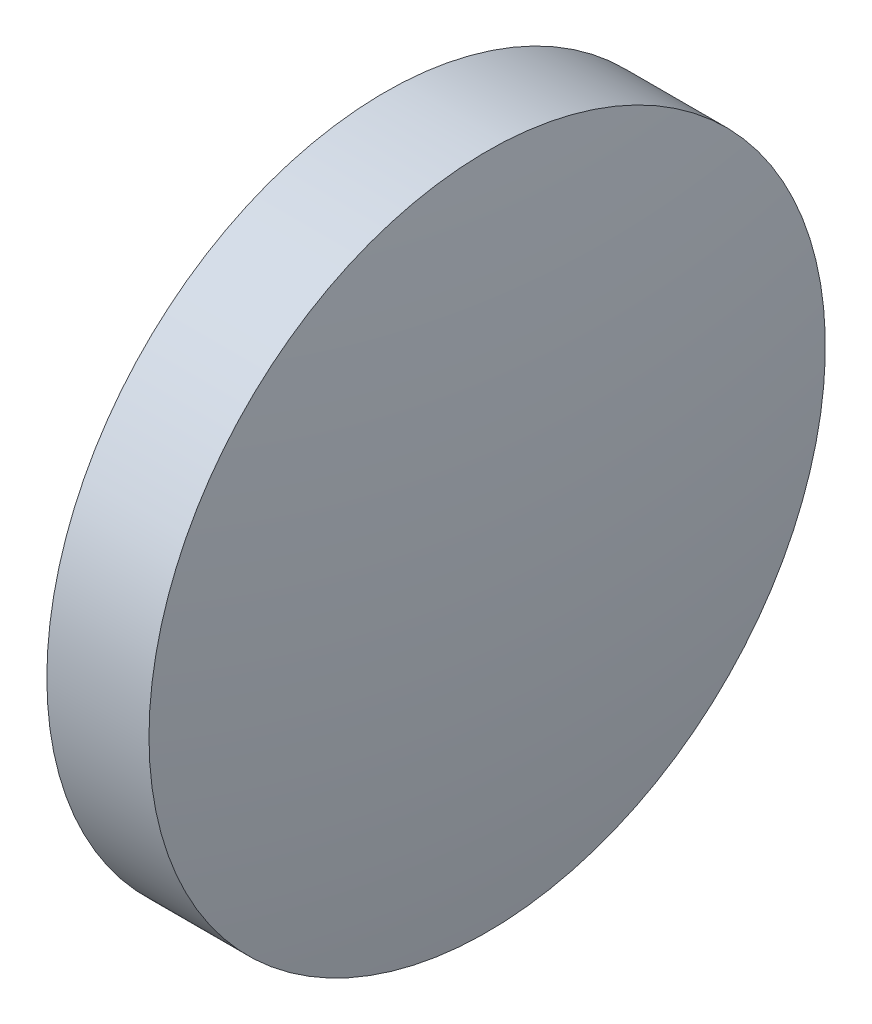
ISO-10303-21;
HEADER;
FILE_DESCRIPTION(('STEP AP214'),'2;1');
FILE_NAME('part.step','',(''),(''),'','','');
FILE_SCHEMA(('AUTOMOTIVE_DESIGN { 1 0 10303 214 1 1 1 1 }'));
ENDSEC;
DATA;
#1=APPLICATION_CONTEXT('core data for automotive mechanical design processes');
#2=APPLICATION_PROTOCOL_DEFINITION('international standard','automotive_design',2000,#1);
#3=PRODUCT_CONTEXT('',#1,'mechanical');
#4=PRODUCT('Part','Part','',(#3));
#5=PRODUCT_RELATED_PRODUCT_CATEGORY('part','',(#4));
#6=PRODUCT_DEFINITION_FORMATION('','',#4);
#7=PRODUCT_DEFINITION_CONTEXT('part definition',#1,'design');
#8=PRODUCT_DEFINITION('design','',#6,#7);
#9=PRODUCT_DEFINITION_SHAPE('','',#8);
#10=(LENGTH_UNIT() NAMED_UNIT(*) SI_UNIT(.MILLI.,.METRE.));
#11=(NAMED_UNIT(*) PLANE_ANGLE_UNIT() SI_UNIT($,.RADIAN.));
#12=(NAMED_UNIT(*) SI_UNIT($,.STERADIAN.) SOLID_ANGLE_UNIT());
#13=UNCERTAINTY_MEASURE_WITH_UNIT(LENGTH_MEASURE(1.E-05),#10,'distance_accuracy_value','');
#14=(GEOMETRIC_REPRESENTATION_CONTEXT(3) GLOBAL_UNCERTAINTY_ASSIGNED_CONTEXT((#13)) GLOBAL_UNIT_ASSIGNED_CONTEXT((#10,
#11,#12)) REPRESENTATION_CONTEXT('',''));
#15=CARTESIAN_POINT('',(0.,0.,0.));
#16=DIRECTION('',(0.,0.,1.));
#17=DIRECTION('',(1.,0.,0.));
#18=AXIS2_PLACEMENT_3D('',#15,#16,#17);
#19=CARTESIAN_POINT('',(1088.59138437667,408.404729277175,0.));
#20=DIRECTION('',(1.,0.,0.));
#21=DIRECTION('',(0.,0.,-1.));
#22=AXIS2_PLACEMENT_3D('',#19,#20,#21);
#23=PLANE('',#22);
#24=CARTESIAN_POINT('',(1088.59138437667,408.404729277175,0.));
#25=DIRECTION('',(-1.,0.,0.));
#26=DIRECTION('',(0.,0.,1.));
#27=AXIS2_PLACEMENT_3D('',#24,#25,#26);
#28=CIRCLE('',#27,5.);
#29=CARTESIAN_POINT('',(1088.59138437667,408.404729277175,5.));
#30=VERTEX_POINT('',#29);
#31=EDGE_CURVE('E43',#30,#30,#28,.T.);
#32=ORIENTED_EDGE('',*,*,#31,.T.);
#33=EDGE_LOOP('',(#32));
#34=FACE_BOUND('',#33,.T.);
#35=ADVANCED_FACE('F37',(#34),#23,.F.);
#36=CARTESIAN_POINT('',(1058.25052621276,408.404729277175,0.00042304035580143));
#37=DIRECTION('',(0.,-1.,0.));
#38=DIRECTION('',(0.,0.,1.));
#39=AXIS2_PLACEMENT_3D('',#36,#37,#38);
#40=CIRCLE('',#39,32.2408581702295);
#41=TRIMMED_CURVE('',#40,(PARAMETER_VALUE(-1.57080944804476)),
(PARAMETER_VALUE(1.57080944804476)),.T.,.PARAMETER.);
#42=CARTESIAN_POINT('',(1058.25052621276,408.404729277175,0.));
#43=DIRECTION('',(-1.,0.,0.));
#44=AXIS1_PLACEMENT('',#42,#43);
#45=SURFACE_OF_REVOLUTION('',#41,#44);
#46=CARTESIAN_POINT('',(1090.10138437667,408.404729277175,0.));
#47=DIRECTION('',(-1.,0.,0.));
#48=DIRECTION('',(0.,0.,1.));
#49=AXIS2_PLACEMENT_3D('',#46,#47,#48);
#50=CIRCLE('',#49,5.);
#51=CARTESIAN_POINT('',(1090.10138437667,408.404729277175,5.));
#52=VERTEX_POINT('',#51);
#53=EDGE_CURVE('E11',#52,#52,#50,.T.);
#54=ORIENTED_EDGE('',*,*,#53,.F.);
#55=EDGE_LOOP('',(#54));
#56=FACE_BOUND('',#55,.T.);
#57=CARTESIAN_POINT('',(1090.49138438021,408.404729277173,0.));
#58=VERTEX_POINT('',#57);
#59=VERTEX_LOOP('',#58);
#60=FACE_BOUND('',#59,.T.);
#61=ADVANCED_FACE('F46',(#56,#60),#45,.T.);
#62=CARTESIAN_POINT('',(1087.3598638026,408.404729277175,0.));
#63=DIRECTION('',(-1.,0.,0.));
#64=DIRECTION('',(0.,0.,1.));
#65=AXIS2_PLACEMENT_3D('',#62,#63,#64);
#66=CYLINDRICAL_SURFACE('',#65,5.);
#67=ORIENTED_EDGE('',*,*,#31,.F.);
#68=EDGE_LOOP('',(#67));
#69=FACE_BOUND('',#68,.T.);
#70=ORIENTED_EDGE('',*,*,#53,.T.);
#71=EDGE_LOOP('',(#70));
#72=FACE_BOUND('',#71,.T.);
#73=ADVANCED_FACE('F48',(#69,#72),#66,.T.);
#74=CLOSED_SHELL('',(#35,#61,#73));
#75=MANIFOLD_SOLID_BREP('B2',#74);
#76=ADVANCED_BREP_SHAPE_REPRESENTATION('',(#18,#75),#14);
#77=SHAPE_DEFINITION_REPRESENTATION(#9,#76);
ENDSEC;
END-ISO-10303-21;
